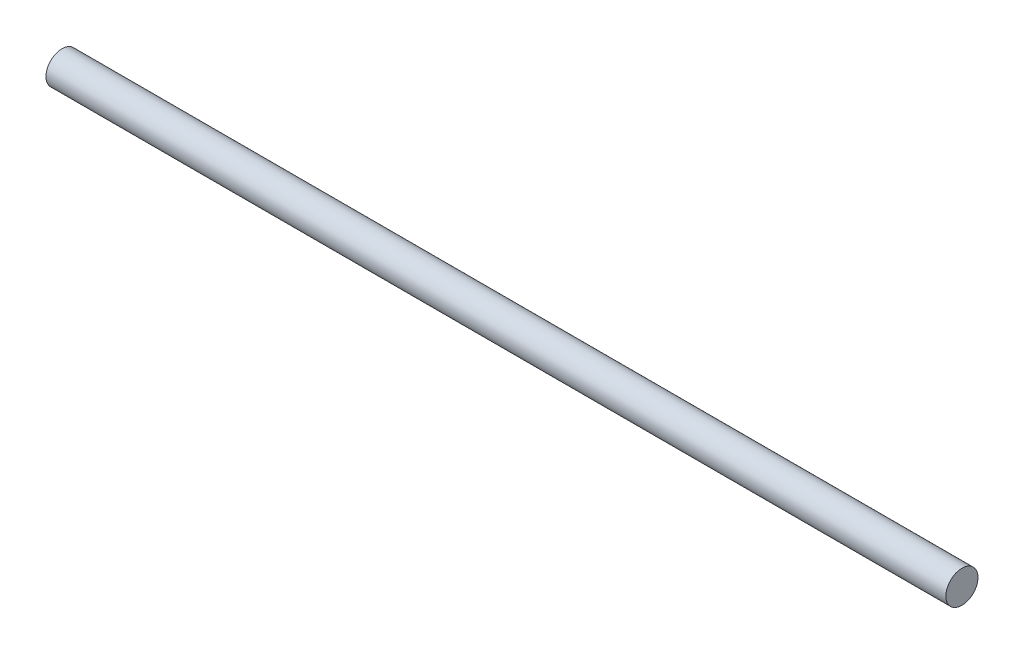
ISO-10303-21;
HEADER;
FILE_DESCRIPTION(('STEP AP214'),'2;1');
FILE_NAME('part.step','',(''),(''),'','','');
FILE_SCHEMA(('AUTOMOTIVE_DESIGN { 1 0 10303 214 1 1 1 1 }'));
ENDSEC;
DATA;
#1=APPLICATION_CONTEXT('core data for automotive mechanical design processes');
#2=APPLICATION_PROTOCOL_DEFINITION('international standard','automotive_design',2000,#1);
#3=PRODUCT_CONTEXT('',#1,'mechanical');
#4=PRODUCT('Part','Part','',(#3));
#5=PRODUCT_RELATED_PRODUCT_CATEGORY('part','',(#4));
#6=PRODUCT_DEFINITION_FORMATION('','',#4);
#7=PRODUCT_DEFINITION_CONTEXT('part definition',#1,'design');
#8=PRODUCT_DEFINITION('design','',#6,#7);
#9=PRODUCT_DEFINITION_SHAPE('','',#8);
#10=(LENGTH_UNIT() NAMED_UNIT(*) SI_UNIT(.MILLI.,.METRE.));
#11=(NAMED_UNIT(*) PLANE_ANGLE_UNIT() SI_UNIT($,.RADIAN.));
#12=(NAMED_UNIT(*) SI_UNIT($,.STERADIAN.) SOLID_ANGLE_UNIT());
#13=UNCERTAINTY_MEASURE_WITH_UNIT(LENGTH_MEASURE(1.E-05),#10,'distance_accuracy_value','');
#14=(GEOMETRIC_REPRESENTATION_CONTEXT(3) GLOBAL_UNCERTAINTY_ASSIGNED_CONTEXT((#13)) GLOBAL_UNIT_ASSIGNED_CONTEXT((#10,
#11,#12)) REPRESENTATION_CONTEXT('',''));
#15=CARTESIAN_POINT('',(0.,0.,0.));
#16=DIRECTION('',(0.,0.,1.));
#17=DIRECTION('',(1.,0.,0.));
#18=AXIS2_PLACEMENT_3D('',#15,#16,#17);
#19=CARTESIAN_POINT('',(70.,0.,0.));
#20=DIRECTION('',(1.,0.,0.));
#21=DIRECTION('',(0.,0.,-1.));
#22=AXIS2_PLACEMENT_3D('',#19,#20,#21);
#23=CYLINDRICAL_SURFACE('',#22,2.5);
#24=CARTESIAN_POINT('',(140.,0.,0.));
#25=DIRECTION('',(1.,0.,0.));
#26=DIRECTION('',(0.,0.,-1.));
#27=AXIS2_PLACEMENT_3D('',#24,#25,#26);
#28=CIRCLE('',#27,2.5);
#29=CARTESIAN_POINT('',(140.,0.,-2.5));
#30=VERTEX_POINT('',#29);
#31=EDGE_CURVE('E10',#30,#30,#28,.T.);
#32=ORIENTED_EDGE('',*,*,#31,.F.);
#33=EDGE_LOOP('',(#32));
#34=FACE_BOUND('',#33,.T.);
#35=CARTESIAN_POINT('',(0.,0.,0.));
#36=DIRECTION('',(1.,0.,0.));
#37=DIRECTION('',(0.,0.,-1.));
#38=AXIS2_PLACEMENT_3D('',#35,#36,#37);
#39=CIRCLE('',#38,2.5);
#40=CARTESIAN_POINT('',(0.,0.,-2.5));
#41=VERTEX_POINT('',#40);
#42=EDGE_CURVE('E21',#41,#41,#39,.T.);
#43=ORIENTED_EDGE('',*,*,#42,.T.);
#44=EDGE_LOOP('',(#43));
#45=FACE_BOUND('',#44,.T.);
#46=ADVANCED_FACE('F17',(#34,#45),#23,.T.);
#47=CARTESIAN_POINT('',(0.,0.,0.));
#48=DIRECTION('',(1.,0.,0.));
#49=DIRECTION('',(0.,0.,-1.));
#50=AXIS2_PLACEMENT_3D('',#47,#48,#49);
#51=PLANE('',#50);
#52=ORIENTED_EDGE('',*,*,#42,.F.);
#53=EDGE_LOOP('',(#52));
#54=FACE_BOUND('',#53,.T.);
#55=ADVANCED_FACE('F31',(#54),#51,.F.);
#56=CARTESIAN_POINT('',(140.,0.,0.));
#57=DIRECTION('',(1.,0.,0.));
#58=DIRECTION('',(0.,0.,-1.));
#59=AXIS2_PLACEMENT_3D('',#56,#57,#58);
#60=PLANE('',#59);
#61=ORIENTED_EDGE('',*,*,#31,.T.);
#62=EDGE_LOOP('',(#61));
#63=FACE_BOUND('',#62,.T.);
#64=ADVANCED_FACE('F19',(#63),#60,.T.);
#65=CLOSED_SHELL('',(#46,#55,#64));
#66=MANIFOLD_SOLID_BREP('B1',#65);
#67=ADVANCED_BREP_SHAPE_REPRESENTATION('',(#18,#66),#14);
#68=SHAPE_DEFINITION_REPRESENTATION(#9,#67);
ENDSEC;
END-ISO-10303-21;
